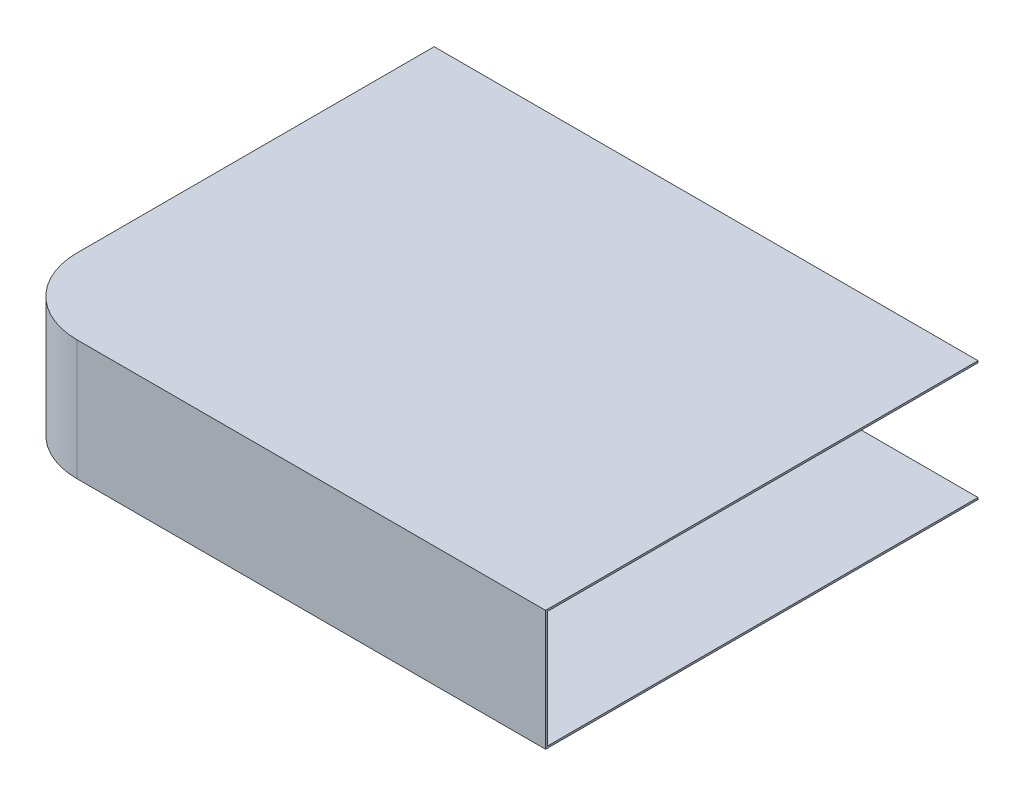
ISO-10303-21;
HEADER;
FILE_DESCRIPTION(('STEP AP214'),'2;1');
FILE_NAME('part.step','',(''),(''),'','','');
FILE_SCHEMA(('AUTOMOTIVE_DESIGN { 1 0 10303 214 1 1 1 1 }'));
ENDSEC;
DATA;
#1=APPLICATION_CONTEXT('core data for automotive mechanical design processes');
#2=APPLICATION_PROTOCOL_DEFINITION('international standard','automotive_design',2000,#1);
#3=PRODUCT_CONTEXT('',#1,'mechanical');
#4=PRODUCT('Part','Part','',(#3));
#5=PRODUCT_RELATED_PRODUCT_CATEGORY('part','',(#4));
#6=PRODUCT_DEFINITION_FORMATION('','',#4);
#7=PRODUCT_DEFINITION_CONTEXT('part definition',#1,'design');
#8=PRODUCT_DEFINITION('design','',#6,#7);
#9=PRODUCT_DEFINITION_SHAPE('','',#8);
#10=(LENGTH_UNIT() NAMED_UNIT(*) SI_UNIT(.MILLI.,.METRE.));
#11=(NAMED_UNIT(*) PLANE_ANGLE_UNIT() SI_UNIT($,.RADIAN.));
#12=(NAMED_UNIT(*) SI_UNIT($,.STERADIAN.) SOLID_ANGLE_UNIT());
#13=UNCERTAINTY_MEASURE_WITH_UNIT(LENGTH_MEASURE(1.E-05),#10,'distance_accuracy_value','');
#14=(GEOMETRIC_REPRESENTATION_CONTEXT(3) GLOBAL_UNCERTAINTY_ASSIGNED_CONTEXT((#13)) GLOBAL_UNIT_ASSIGNED_CONTEXT((#10,
#11,#12)) REPRESENTATION_CONTEXT('',''));
#15=CARTESIAN_POINT('',(0.,0.,0.));
#16=DIRECTION('',(0.,0.,1.));
#17=DIRECTION('',(1.,0.,0.));
#18=AXIS2_PLACEMENT_3D('',#15,#16,#17);
#19=CARTESIAN_POINT('',(144.607899286529,32.,0.));
#20=DIRECTION('',(-1.,0.,0.));
#21=DIRECTION('',(0.,0.,1.));
#22=AXIS2_PLACEMENT_3D('',#19,#20,#21);
#23=PLANE('',#22);
#24=DIRECTION('',(0.,0.,-1.));
#25=VECTOR('',#24,1.);
#26=CARTESIAN_POINT('',(144.607899286529,0.,0.));
#27=LINE('',#26,#25);
#28=CARTESIAN_POINT('',(144.607899286529,0.,0.));
#29=VERTEX_POINT('',#28);
#30=CARTESIAN_POINT('',(144.607899286529,0.,-114.986152897931));
#31=VERTEX_POINT('',#30);
#32=EDGE_CURVE('E134',#29,#31,#27,.T.);
#33=ORIENTED_EDGE('',*,*,#32,.T.);
#34=DIRECTION('',(0.,-1.,0.));
#35=VECTOR('',#34,1.);
#36=CARTESIAN_POINT('',(144.607899286529,0.,-114.986152897931));
#37=LINE('',#36,#35);
#38=CARTESIAN_POINT('',(144.607899286529,0.5,-114.986152897931));
#39=VERTEX_POINT('',#38);
#40=EDGE_CURVE('E117',#39,#31,#37,.T.);
#41=ORIENTED_EDGE('',*,*,#40,.F.);
#42=DIRECTION('',(0.,0.,-1.));
#43=VECTOR('',#42,1.);
#44=CARTESIAN_POINT('',(144.607899286529,0.5,-20.));
#45=LINE('',#44,#43);
#46=CARTESIAN_POINT('',(144.607899286529,0.5,-0.5));
#47=VERTEX_POINT('',#46);
#48=EDGE_CURVE('E192',#47,#39,#45,.T.);
#49=ORIENTED_EDGE('',*,*,#48,.F.);
#50=DIRECTION('',(0.,-1.,0.));
#51=VECTOR('',#50,1.);
#52=CARTESIAN_POINT('',(144.607899286529,32.,-0.5));
#53=LINE('',#52,#51);
#54=CARTESIAN_POINT('',(144.607899286529,31.5,-0.5));
#55=VERTEX_POINT('',#54);
#56=EDGE_CURVE('E197',#55,#47,#53,.T.);
#57=ORIENTED_EDGE('',*,*,#56,.F.);
#58=DIRECTION('',(0.,0.,-1.));
#59=VECTOR('',#58,1.);
#60=CARTESIAN_POINT('',(144.607899286529,31.5,-20.));
#61=LINE('',#60,#59);
#62=CARTESIAN_POINT('',(144.607899286529,31.5,-114.986152897931));
#63=VERTEX_POINT('',#62);
#64=EDGE_CURVE('E63',#55,#63,#61,.T.);
#65=ORIENTED_EDGE('',*,*,#64,.T.);
#66=CARTESIAN_POINT('',(144.607899286529,32.,-114.986152897931));
#67=VERTEX_POINT('',#66);
#68=EDGE_CURVE('E127',#67,#63,#37,.T.);
#69=ORIENTED_EDGE('',*,*,#68,.F.);
#70=DIRECTION('',(0.,0.,-1.));
#71=VECTOR('',#70,1.);
#72=CARTESIAN_POINT('',(144.607899286529,32.,0.));
#73=LINE('',#72,#71);
#74=CARTESIAN_POINT('',(144.607899286529,32.,0.));
#75=VERTEX_POINT('',#74);
#76=EDGE_CURVE('E163',#75,#67,#73,.T.);
#77=ORIENTED_EDGE('',*,*,#76,.F.);
#78=DIRECTION('',(0.,-1.,0.));
#79=VECTOR('',#78,1.);
#80=CARTESIAN_POINT('',(144.607899286529,32.,0.));
#81=LINE('',#80,#79);
#82=EDGE_CURVE('E143',#75,#29,#81,.T.);
#83=ORIENTED_EDGE('',*,*,#82,.T.);
#84=EDGE_LOOP('',(#33,#41,#49,#57,#65,#69,#77,#83));
#85=FACE_BOUND('',#84,.T.);
#86=ADVANCED_FACE('F41',(#85),#23,.F.);
#87=CARTESIAN_POINT('',(0.,32.,-20.0000000000001));
#88=DIRECTION('',(1.,0.,0.));
#89=DIRECTION('',(0.,0.,-1.));
#90=AXIS2_PLACEMENT_3D('',#87,#88,#89);
#91=PLANE('',#90);
#92=DIRECTION('',(0.,0.,1.));
#93=VECTOR('',#92,1.);
#94=CARTESIAN_POINT('',(0.,32.,-20.0000000000001));
#95=LINE('',#94,#93);
#96=CARTESIAN_POINT('',(0.,32.,-114.986152897931));
#97=VERTEX_POINT('',#96);
#98=CARTESIAN_POINT('',(0.,32.,-20.0000000000001));
#99=VERTEX_POINT('',#98);
#100=EDGE_CURVE('E186',#97,#99,#95,.T.);
#101=ORIENTED_EDGE('',*,*,#100,.F.);
#102=DIRECTION('',(0.,1.,0.));
#103=VECTOR('',#102,1.);
#104=CARTESIAN_POINT('',(0.,0.,-114.986152897931));
#105=LINE('',#104,#103);
#106=CARTESIAN_POINT('',(0.,0.,-114.986152897931));
#107=VERTEX_POINT('',#106);
#108=EDGE_CURVE('E138',#107,#97,#105,.T.);
#109=ORIENTED_EDGE('',*,*,#108,.F.);
#110=DIRECTION('',(0.,0.,1.));
#111=VECTOR('',#110,1.);
#112=CARTESIAN_POINT('',(0.,0.,-20.0000000000001));
#113=LINE('',#112,#111);
#114=CARTESIAN_POINT('',(0.,0.,-20.0000000000001));
#115=VERTEX_POINT('',#114);
#116=EDGE_CURVE('E136',#107,#115,#113,.T.);
#117=ORIENTED_EDGE('',*,*,#116,.T.);
#118=DIRECTION('',(0.,-1.,0.));
#119=VECTOR('',#118,1.);
#120=CARTESIAN_POINT('',(0.,32.,-20.0000000000001));
#121=LINE('',#120,#119);
#122=EDGE_CURVE('E49',#99,#115,#121,.T.);
#123=ORIENTED_EDGE('',*,*,#122,.F.);
#124=EDGE_LOOP('',(#101,#109,#117,#123));
#125=FACE_BOUND('',#124,.T.);
#126=ADVANCED_FACE('F261',(#125),#91,.F.);
#127=CARTESIAN_POINT('',(20.,32.,-20.));
#128=DIRECTION('',(0.,-1.,0.));
#129=DIRECTION('',(0.,0.,-1.));
#130=AXIS2_PLACEMENT_3D('',#127,#128,#129);
#131=CYLINDRICAL_SURFACE('',#130,20.);
#132=CARTESIAN_POINT('',(20.,0.,-20.));
#133=DIRECTION('',(0.,1.,0.));
#134=DIRECTION('',(0.,0.,-1.));
#135=AXIS2_PLACEMENT_3D('',#132,#133,#134);
#136=CIRCLE('',#135,20.);
#137=CARTESIAN_POINT('',(20.0000000000001,0.,0.));
#138=VERTEX_POINT('',#137);
#139=EDGE_CURVE('E149',#115,#138,#136,.T.);
#140=ORIENTED_EDGE('',*,*,#139,.T.);
#141=DIRECTION('',(0.,-1.,0.));
#142=VECTOR('',#141,1.);
#143=CARTESIAN_POINT('',(20.0000000000001,32.,0.));
#144=LINE('',#143,#142);
#145=CARTESIAN_POINT('',(20.0000000000001,32.,0.));
#146=VERTEX_POINT('',#145);
#147=EDGE_CURVE('E166',#146,#138,#144,.T.);
#148=ORIENTED_EDGE('',*,*,#147,.F.);
#149=CARTESIAN_POINT('',(20.,32.,-20.));
#150=DIRECTION('',(0.,1.,0.));
#151=DIRECTION('',(0.,0.,-1.));
#152=AXIS2_PLACEMENT_3D('',#149,#150,#151);
#153=CIRCLE('',#152,20.);
#154=EDGE_CURVE('E176',#99,#146,#153,.T.);
#155=ORIENTED_EDGE('',*,*,#154,.F.);
#156=ORIENTED_EDGE('',*,*,#122,.T.);
#157=EDGE_LOOP('',(#140,#148,#155,#156));
#158=FACE_BOUND('',#157,.T.);
#159=ADVANCED_FACE('F174',(#158),#131,.T.);
#160=CARTESIAN_POINT('',(20.0000000000001,32.,0.));
#161=DIRECTION('',(0.,0.,-1.));
#162=DIRECTION('',(-1.,0.,0.));
#163=AXIS2_PLACEMENT_3D('',#160,#161,#162);
#164=PLANE('',#163);
#165=DIRECTION('',(1.,0.,0.));
#166=VECTOR('',#165,1.);
#167=CARTESIAN_POINT('',(20.0000000000001,0.,0.));
#168=LINE('',#167,#166);
#169=EDGE_CURVE('E160',#138,#29,#168,.T.);
#170=ORIENTED_EDGE('',*,*,#169,.T.);
#171=ORIENTED_EDGE('',*,*,#82,.F.);
#172=DIRECTION('',(1.,0.,0.));
#173=VECTOR('',#172,1.);
#174=CARTESIAN_POINT('',(20.0000000000001,32.,0.));
#175=LINE('',#174,#173);
#176=EDGE_CURVE('E155',#146,#75,#175,.T.);
#177=ORIENTED_EDGE('',*,*,#176,.F.);
#178=ORIENTED_EDGE('',*,*,#147,.T.);
#179=EDGE_LOOP('',(#170,#171,#177,#178));
#180=FACE_BOUND('',#179,.T.);
#181=ADVANCED_FACE('F180',(#180),#164,.F.);
#182=CARTESIAN_POINT('',(20.,32.,-20.));
#183=DIRECTION('',(0.,-1.,0.));
#184=DIRECTION('',(0.,0.,-1.));
#185=AXIS2_PLACEMENT_3D('',#182,#183,#184);
#186=PLANE('',#185);
#187=ORIENTED_EDGE('',*,*,#76,.T.);
#188=DIRECTION('',(1.,0.,0.));
#189=VECTOR('',#188,1.);
#190=CARTESIAN_POINT('',(144.607899286529,32.,-114.986152897931));
#191=LINE('',#190,#189);
#192=EDGE_CURVE('E227',#97,#67,#191,.T.);
#193=ORIENTED_EDGE('',*,*,#192,.F.);
#194=ORIENTED_EDGE('',*,*,#100,.T.);
#195=ORIENTED_EDGE('',*,*,#154,.T.);
#196=ORIENTED_EDGE('',*,*,#176,.T.);
#197=EDGE_LOOP('',(#187,#193,#194,#195,#196));
#198=FACE_BOUND('',#197,.T.);
#199=ADVANCED_FACE('F272',(#198),#186,.F.);
#200=CARTESIAN_POINT('',(20.,0.,-20.));
#201=DIRECTION('',(0.,-1.,0.));
#202=DIRECTION('',(0.,0.,-1.));
#203=AXIS2_PLACEMENT_3D('',#200,#201,#202);
#204=PLANE('',#203);
#205=DIRECTION('',(-1.,0.,0.));
#206=VECTOR('',#205,1.);
#207=CARTESIAN_POINT('',(144.607899286529,0.,-114.986152897931));
#208=LINE('',#207,#206);
#209=EDGE_CURVE('E120',#31,#107,#208,.T.);
#210=ORIENTED_EDGE('',*,*,#209,.F.);
#211=ORIENTED_EDGE('',*,*,#32,.F.);
#212=ORIENTED_EDGE('',*,*,#169,.F.);
#213=ORIENTED_EDGE('',*,*,#139,.F.);
#214=ORIENTED_EDGE('',*,*,#116,.F.);
#215=EDGE_LOOP('',(#210,#211,#212,#213,#214));
#216=FACE_BOUND('',#215,.T.);
#217=ADVANCED_FACE('F132',(#216),#204,.T.);
#218=CARTESIAN_POINT('',(0.5,32.,-20.0000000000001));
#219=DIRECTION('',(1.,0.,0.));
#220=DIRECTION('',(0.,0.,-1.));
#221=AXIS2_PLACEMENT_3D('',#218,#219,#220);
#222=PLANE('',#221);
#223=DIRECTION('',(0.,-1.,0.));
#224=VECTOR('',#223,1.);
#225=CARTESIAN_POINT('',(0.5,32.,-114.986152897931));
#226=LINE('',#225,#224);
#227=CARTESIAN_POINT('',(0.5,31.5,-114.986152897931));
#228=VERTEX_POINT('',#227);
#229=CARTESIAN_POINT('',(0.5,0.5,-114.986152897931));
#230=VERTEX_POINT('',#229);
#231=EDGE_CURVE('E56',#228,#230,#226,.T.);
#232=ORIENTED_EDGE('',*,*,#231,.F.);
#233=DIRECTION('',(0.,0.,1.));
#234=VECTOR('',#233,1.);
#235=CARTESIAN_POINT('',(0.5,31.5,-20.));
#236=LINE('',#235,#234);
#237=CARTESIAN_POINT('',(0.5,31.5,-20.0000000000001));
#238=VERTEX_POINT('',#237);
#239=EDGE_CURVE('E204',#228,#238,#236,.T.);
#240=ORIENTED_EDGE('',*,*,#239,.T.);
#241=DIRECTION('',(0.,-1.,0.));
#242=VECTOR('',#241,1.);
#243=CARTESIAN_POINT('',(0.5,32.,-20.0000000000001));
#244=LINE('',#243,#242);
#245=CARTESIAN_POINT('',(0.5,0.5,-20.0000000000001));
#246=VERTEX_POINT('',#245);
#247=EDGE_CURVE('E145',#238,#246,#244,.T.);
#248=ORIENTED_EDGE('',*,*,#247,.T.);
#249=DIRECTION('',(0.,0.,1.));
#250=VECTOR('',#249,1.);
#251=CARTESIAN_POINT('',(0.5,0.5,-20.));
#252=LINE('',#251,#250);
#253=EDGE_CURVE('E195',#230,#246,#252,.T.);
#254=ORIENTED_EDGE('',*,*,#253,.F.);
#255=EDGE_LOOP('',(#232,#240,#248,#254));
#256=FACE_BOUND('',#255,.T.);
#257=ADVANCED_FACE('F248',(#256),#222,.T.);
#258=CARTESIAN_POINT('',(20.,32.,-20.));
#259=DIRECTION('',(0.,-1.,0.));
#260=DIRECTION('',(0.,0.,-1.));
#261=AXIS2_PLACEMENT_3D('',#258,#259,#260);
#262=CYLINDRICAL_SURFACE('',#261,19.5);
#263=CARTESIAN_POINT('',(20.,0.5,-20.));
#264=DIRECTION('',(0.,-1.,0.));
#265=DIRECTION('',(0.,0.,-1.));
#266=AXIS2_PLACEMENT_3D('',#263,#264,#265);
#267=CIRCLE('',#266,19.5);
#268=CARTESIAN_POINT('',(20.0000000000001,0.5,-0.5));
#269=VERTEX_POINT('',#268);
#270=EDGE_CURVE('E211',#246,#269,#267,.F.);
#271=ORIENTED_EDGE('',*,*,#270,.F.);
#272=ORIENTED_EDGE('',*,*,#247,.F.);
#273=CARTESIAN_POINT('',(20.,31.5,-20.));
#274=DIRECTION('',(0.,-1.,0.));
#275=DIRECTION('',(0.,0.,-1.));
#276=AXIS2_PLACEMENT_3D('',#273,#274,#275);
#277=CIRCLE('',#276,19.5);
#278=CARTESIAN_POINT('',(20.0000000000001,31.5,-0.5));
#279=VERTEX_POINT('',#278);
#280=EDGE_CURVE('E208',#238,#279,#277,.F.);
#281=ORIENTED_EDGE('',*,*,#280,.T.);
#282=DIRECTION('',(0.,1.,0.));
#283=VECTOR('',#282,1.);
#284=CARTESIAN_POINT('',(20.0000000000001,32.,-0.5));
#285=LINE('',#284,#283);
#286=EDGE_CURVE('E152',#279,#269,#285,.F.);
#287=ORIENTED_EDGE('',*,*,#286,.T.);
#288=EDGE_LOOP('',(#271,#272,#281,#287));
#289=FACE_BOUND('',#288,.T.);
#290=ADVANCED_FACE('F245',(#289),#262,.F.);
#291=CARTESIAN_POINT('',(20.0000000000001,32.,-0.5));
#292=DIRECTION('',(0.,0.,-1.));
#293=DIRECTION('',(-1.,0.,0.));
#294=AXIS2_PLACEMENT_3D('',#291,#292,#293);
#295=PLANE('',#294);
#296=DIRECTION('',(1.,0.,0.));
#297=VECTOR('',#296,1.);
#298=CARTESIAN_POINT('',(20.,0.5,-0.5));
#299=LINE('',#298,#297);
#300=EDGE_CURVE('E205',#269,#47,#299,.T.);
#301=ORIENTED_EDGE('',*,*,#300,.F.);
#302=ORIENTED_EDGE('',*,*,#286,.F.);
#303=DIRECTION('',(1.,0.,0.));
#304=VECTOR('',#303,1.);
#305=CARTESIAN_POINT('',(20.,31.5,-0.5));
#306=LINE('',#305,#304);
#307=EDGE_CURVE('E201',#279,#55,#306,.T.);
#308=ORIENTED_EDGE('',*,*,#307,.T.);
#309=ORIENTED_EDGE('',*,*,#56,.T.);
#310=EDGE_LOOP('',(#301,#302,#308,#309));
#311=FACE_BOUND('',#310,.T.);
#312=ADVANCED_FACE('F240',(#311),#295,.T.);
#313=CARTESIAN_POINT('',(20.,31.5,-20.));
#314=DIRECTION('',(0.,-1.,0.));
#315=DIRECTION('',(0.,0.,-1.));
#316=AXIS2_PLACEMENT_3D('',#313,#314,#315);
#317=PLANE('',#316);
#318=DIRECTION('',(-1.,0.,0.));
#319=VECTOR('',#318,1.);
#320=CARTESIAN_POINT('',(20.,31.5,-114.986152897931));
#321=LINE('',#320,#319);
#322=EDGE_CURVE('E196',#63,#228,#321,.T.);
#323=ORIENTED_EDGE('',*,*,#322,.F.);
#324=ORIENTED_EDGE('',*,*,#64,.F.);
#325=ORIENTED_EDGE('',*,*,#307,.F.);
#326=ORIENTED_EDGE('',*,*,#280,.F.);
#327=ORIENTED_EDGE('',*,*,#239,.F.);
#328=EDGE_LOOP('',(#323,#324,#325,#326,#327));
#329=FACE_BOUND('',#328,.T.);
#330=ADVANCED_FACE('F235',(#329),#317,.T.);
#331=CARTESIAN_POINT('',(20.,0.5,-20.));
#332=DIRECTION('',(0.,-1.,0.));
#333=DIRECTION('',(0.,0.,-1.));
#334=AXIS2_PLACEMENT_3D('',#331,#332,#333);
#335=PLANE('',#334);
#336=ORIENTED_EDGE('',*,*,#48,.T.);
#337=DIRECTION('',(-1.,0.,0.));
#338=VECTOR('',#337,1.);
#339=CARTESIAN_POINT('',(20.,0.5,-114.986152897931));
#340=LINE('',#339,#338);
#341=EDGE_CURVE('E11',#39,#230,#340,.T.);
#342=ORIENTED_EDGE('',*,*,#341,.T.);
#343=ORIENTED_EDGE('',*,*,#253,.T.);
#344=ORIENTED_EDGE('',*,*,#270,.T.);
#345=ORIENTED_EDGE('',*,*,#300,.T.);
#346=EDGE_LOOP('',(#336,#342,#343,#344,#345));
#347=FACE_BOUND('',#346,.T.);
#348=ADVANCED_FACE('F250',(#347),#335,.F.);
#349=CARTESIAN_POINT('',(0.,0.,-114.986152897931));
#350=DIRECTION('',(0.,0.,1.));
#351=DIRECTION('',(1.,0.,0.));
#352=AXIS2_PLACEMENT_3D('',#349,#350,#351);
#353=PLANE('',#352);
#354=ORIENTED_EDGE('',*,*,#322,.T.);
#355=ORIENTED_EDGE('',*,*,#231,.T.);
#356=ORIENTED_EDGE('',*,*,#341,.F.);
#357=ORIENTED_EDGE('',*,*,#40,.T.);
#358=ORIENTED_EDGE('',*,*,#209,.T.);
#359=ORIENTED_EDGE('',*,*,#108,.T.);
#360=ORIENTED_EDGE('',*,*,#192,.T.);
#361=ORIENTED_EDGE('',*,*,#68,.T.);
#362=EDGE_LOOP('',(#354,#355,#356,#357,#358,#359,#360,#361));
#363=FACE_BOUND('',#362,.T.);
#364=ADVANCED_FACE('F119',(#363),#353,.F.);
#365=CLOSED_SHELL('',(#86,#126,#159,#181,#199,#217,#257,#290,#312,#330,#348,#364));
#366=MANIFOLD_SOLID_BREP('B2',#365);
#367=ADVANCED_BREP_SHAPE_REPRESENTATION('',(#18,#366),#14);
#368=SHAPE_DEFINITION_REPRESENTATION(#9,#367);
ENDSEC;
END-ISO-10303-21;
